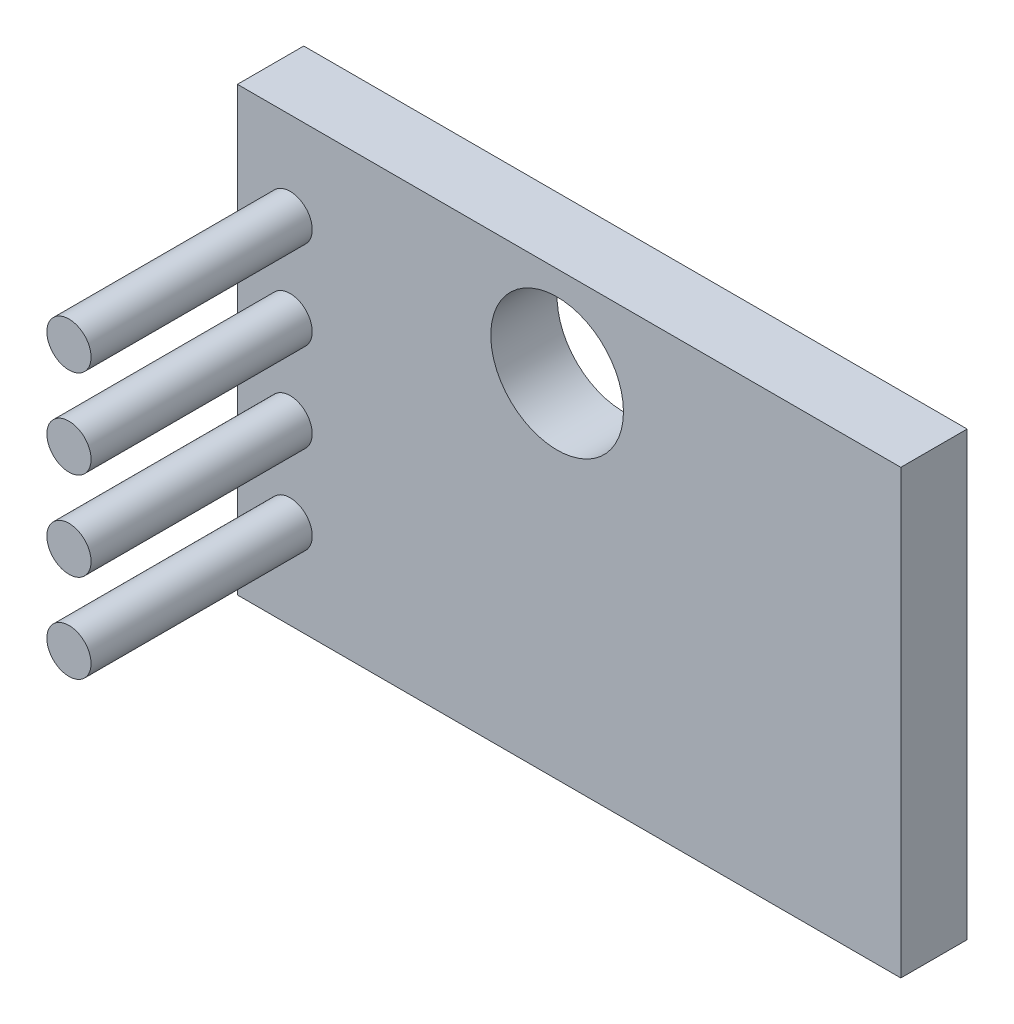
ISO-10303-21;
HEADER;
FILE_DESCRIPTION(('STEP AP214'),'2;1');
FILE_NAME('part.step','',(''),(''),'','','');
FILE_SCHEMA(('AUTOMOTIVE_DESIGN { 1 0 10303 214 1 1 1 1 }'));
ENDSEC;
DATA;
#1=APPLICATION_CONTEXT('core data for automotive mechanical design processes');
#2=APPLICATION_PROTOCOL_DEFINITION('international standard','automotive_design',2000,#1);
#3=PRODUCT_CONTEXT('',#1,'mechanical');
#4=PRODUCT('Part','Part','',(#3));
#5=PRODUCT_RELATED_PRODUCT_CATEGORY('part','',(#4));
#6=PRODUCT_DEFINITION_FORMATION('','',#4);
#7=PRODUCT_DEFINITION_CONTEXT('part definition',#1,'design');
#8=PRODUCT_DEFINITION('design','',#6,#7);
#9=PRODUCT_DEFINITION_SHAPE('','',#8);
#10=(LENGTH_UNIT() NAMED_UNIT(*) SI_UNIT(.MILLI.,.METRE.));
#11=(NAMED_UNIT(*) PLANE_ANGLE_UNIT() SI_UNIT($,.RADIAN.));
#12=(NAMED_UNIT(*) SI_UNIT($,.STERADIAN.) SOLID_ANGLE_UNIT());
#13=UNCERTAINTY_MEASURE_WITH_UNIT(LENGTH_MEASURE(1.E-05),#10,'distance_accuracy_value','');
#14=(GEOMETRIC_REPRESENTATION_CONTEXT(3) GLOBAL_UNCERTAINTY_ASSIGNED_CONTEXT((#13)) GLOBAL_UNIT_ASSIGNED_CONTEXT((#10,
#11,#12)) REPRESENTATION_CONTEXT('',''));
#15=CARTESIAN_POINT('',(0.,0.,0.));
#16=DIRECTION('',(0.,0.,1.));
#17=DIRECTION('',(1.,0.,0.));
#18=AXIS2_PLACEMENT_3D('',#15,#16,#17);
#19=CARTESIAN_POINT('',(0.,0.,1.5));
#20=DIRECTION('',(0.,0.,-1.));
#21=DIRECTION('',(-1.,0.,0.));
#22=AXIS2_PLACEMENT_3D('',#19,#20,#21);
#23=PLANE('',#22);
#24=CARTESIAN_POINT('',(157.774202418967,66.5911476545182,1.5));
#25=DIRECTION('',(0.,0.,-1.));
#26=DIRECTION('',(-1.,0.,0.));
#27=AXIS2_PLACEMENT_3D('',#24,#25,#26);
#28=CIRCLE('',#27,0.499999999999999);
#29=CARTESIAN_POINT('',(157.274202418967,66.5911476545182,1.5));
#30=VERTEX_POINT('',#29);
#31=EDGE_CURVE('E11',#30,#30,#28,.F.);
#32=ORIENTED_EDGE('',*,*,#31,.F.);
#33=EDGE_LOOP('',(#32));
#34=FACE_BOUND('',#33,.T.);
#35=CARTESIAN_POINT('',(157.774202418967,64.5911476545182,1.5));
#36=DIRECTION('',(0.,0.,-1.));
#37=DIRECTION('',(-1.,0.,0.));
#38=AXIS2_PLACEMENT_3D('',#35,#36,#37);
#39=CIRCLE('',#38,0.499999999999999);
#40=CARTESIAN_POINT('',(157.274202418967,64.5911476545182,1.5));
#41=VERTEX_POINT('',#40);
#42=EDGE_CURVE('E41',#41,#41,#39,.F.);
#43=ORIENTED_EDGE('',*,*,#42,.F.);
#44=EDGE_LOOP('',(#43));
#45=FACE_BOUND('',#44,.T.);
#46=CARTESIAN_POINT('',(157.774202418967,70.5911476545182,1.5));
#47=DIRECTION('',(0.,0.,-1.));
#48=DIRECTION('',(-1.,0.,0.));
#49=AXIS2_PLACEMENT_3D('',#46,#47,#48);
#50=CIRCLE('',#49,0.499999999999999);
#51=CARTESIAN_POINT('',(157.274202418967,70.5911476545182,1.5));
#52=VERTEX_POINT('',#51);
#53=EDGE_CURVE('E113',#52,#52,#50,.F.);
#54=ORIENTED_EDGE('',*,*,#53,.F.);
#55=EDGE_LOOP('',(#54));
#56=FACE_BOUND('',#55,.T.);
#57=CARTESIAN_POINT('',(157.774202418967,68.5911476545182,1.5));
#58=DIRECTION('',(0.,0.,-1.));
#59=DIRECTION('',(-1.,0.,0.));
#60=AXIS2_PLACEMENT_3D('',#57,#58,#59);
#61=CIRCLE('',#60,0.499999999999999);
#62=CARTESIAN_POINT('',(157.274202418967,68.5911476545182,1.5));
#63=VERTEX_POINT('',#62);
#64=EDGE_CURVE('E110',#63,#63,#61,.F.);
#65=ORIENTED_EDGE('',*,*,#64,.F.);
#66=EDGE_LOOP('',(#65));
#67=FACE_BOUND('',#66,.T.);
#68=DIRECTION('',(0.,-1.,0.));
#69=VECTOR('',#68,1.);
#70=CARTESIAN_POINT('',(156.583059713969,62.5911476545182,1.5));
#71=LINE('',#70,#69);
#72=CARTESIAN_POINT('',(156.583059713969,72.5911476545182,1.5));
#73=VERTEX_POINT('',#72);
#74=CARTESIAN_POINT('',(156.583059713969,62.5911476545182,1.5));
#75=VERTEX_POINT('',#74);
#76=EDGE_CURVE('E85',#73,#75,#71,.T.);
#77=ORIENTED_EDGE('',*,*,#76,.T.);
#78=DIRECTION('',(1.,0.,0.));
#79=VECTOR('',#78,1.);
#80=CARTESIAN_POINT('',(156.583059713969,62.5911476545182,1.5));
#81=LINE('',#80,#79);
#82=CARTESIAN_POINT('',(171.583059713969,62.5911476545182,1.5));
#83=VERTEX_POINT('',#82);
#84=EDGE_CURVE('E80',#75,#83,#81,.T.);
#85=ORIENTED_EDGE('',*,*,#84,.T.);
#86=DIRECTION('',(0.,1.,0.));
#87=VECTOR('',#86,1.);
#88=CARTESIAN_POINT('',(171.583059713969,62.5911476545182,1.5));
#89=LINE('',#88,#87);
#90=CARTESIAN_POINT('',(171.583059713969,72.5911476545182,1.5));
#91=VERTEX_POINT('',#90);
#92=EDGE_CURVE('E83',#83,#91,#89,.T.);
#93=ORIENTED_EDGE('',*,*,#92,.T.);
#94=DIRECTION('',(-1.,0.,0.));
#95=VECTOR('',#94,1.);
#96=CARTESIAN_POINT('',(156.583059713969,72.5911476545182,1.5));
#97=LINE('',#96,#95);
#98=EDGE_CURVE('E49',#91,#73,#97,.T.);
#99=ORIENTED_EDGE('',*,*,#98,.T.);
#100=EDGE_LOOP('',(#77,#85,#93,#99));
#101=FACE_BOUND('',#100,.T.);
#102=CARTESIAN_POINT('',(163.811741983301,70.542925261811,1.5));
#103=DIRECTION('',(0.,0.,1.));
#104=DIRECTION('',(1.,0.,0.));
#105=AXIS2_PLACEMENT_3D('',#102,#103,#104);
#106=CIRCLE('',#105,1.5);
#107=CARTESIAN_POINT('',(165.311741983301,70.542925261811,1.5));
#108=VERTEX_POINT('',#107);
#109=EDGE_CURVE('E103',#108,#108,#106,.T.);
#110=ORIENTED_EDGE('',*,*,#109,.F.);
#111=EDGE_LOOP('',(#110));
#112=FACE_BOUND('',#111,.T.);
#113=ADVANCED_FACE('F32',(#34,#45,#56,#67,#101,#112),#23,.F.);
#114=CARTESIAN_POINT('',(0.,0.,0.));
#115=DIRECTION('',(0.,0.,-1.));
#116=DIRECTION('',(-1.,0.,0.));
#117=AXIS2_PLACEMENT_3D('',#114,#115,#116);
#118=PLANE('',#117);
#119=DIRECTION('',(0.,-1.,0.));
#120=VECTOR('',#119,1.);
#121=CARTESIAN_POINT('',(156.583059713969,62.5911476545182,0.));
#122=LINE('',#121,#120);
#123=CARTESIAN_POINT('',(156.583059713969,72.5911476545182,0.));
#124=VERTEX_POINT('',#123);
#125=CARTESIAN_POINT('',(156.583059713969,62.5911476545182,0.));
#126=VERTEX_POINT('',#125);
#127=EDGE_CURVE('E100',#124,#126,#122,.T.);
#128=ORIENTED_EDGE('',*,*,#127,.F.);
#129=DIRECTION('',(-1.,0.,0.));
#130=VECTOR('',#129,1.);
#131=CARTESIAN_POINT('',(156.583059713969,72.5911476545182,0.));
#132=LINE('',#131,#130);
#133=CARTESIAN_POINT('',(171.583059713969,72.5911476545182,0.));
#134=VERTEX_POINT('',#133);
#135=EDGE_CURVE('E72',#134,#124,#132,.T.);
#136=ORIENTED_EDGE('',*,*,#135,.F.);
#137=DIRECTION('',(0.,1.,0.));
#138=VECTOR('',#137,1.);
#139=CARTESIAN_POINT('',(171.583059713969,62.5911476545182,0.));
#140=LINE('',#139,#138);
#141=CARTESIAN_POINT('',(171.583059713969,62.5911476545182,0.));
#142=VERTEX_POINT('',#141);
#143=EDGE_CURVE('E66',#142,#134,#140,.T.);
#144=ORIENTED_EDGE('',*,*,#143,.F.);
#145=DIRECTION('',(1.,0.,0.));
#146=VECTOR('',#145,1.);
#147=CARTESIAN_POINT('',(156.583059713969,62.5911476545182,0.));
#148=LINE('',#147,#146);
#149=EDGE_CURVE('E90',#126,#142,#148,.T.);
#150=ORIENTED_EDGE('',*,*,#149,.F.);
#151=EDGE_LOOP('',(#128,#136,#144,#150));
#152=FACE_BOUND('',#151,.T.);
#153=CARTESIAN_POINT('',(163.811741983301,70.542925261811,0.));
#154=DIRECTION('',(0.,0.,1.));
#155=DIRECTION('',(1.,0.,0.));
#156=AXIS2_PLACEMENT_3D('',#153,#154,#155);
#157=CIRCLE('',#156,1.5);
#158=CARTESIAN_POINT('',(165.311741983301,70.542925261811,0.));
#159=VERTEX_POINT('',#158);
#160=EDGE_CURVE('E165',#159,#159,#157,.T.);
#161=ORIENTED_EDGE('',*,*,#160,.T.);
#162=EDGE_LOOP('',(#161));
#163=FACE_BOUND('',#162,.T.);
#164=ADVANCED_FACE('F122',(#152,#163),#118,.T.);
#165=CARTESIAN_POINT('',(156.583059713969,62.5911476545182,1.5));
#166=DIRECTION('',(1.,0.,0.));
#167=DIRECTION('',(0.,0.,-1.));
#168=AXIS2_PLACEMENT_3D('',#165,#166,#167);
#169=PLANE('',#168);
#170=ORIENTED_EDGE('',*,*,#127,.T.);
#171=DIRECTION('',(0.,0.,-1.));
#172=VECTOR('',#171,1.);
#173=CARTESIAN_POINT('',(156.583059713969,62.5911476545182,1.5));
#174=LINE('',#173,#172);
#175=EDGE_CURVE('E91',#75,#126,#174,.T.);
#176=ORIENTED_EDGE('',*,*,#175,.F.);
#177=ORIENTED_EDGE('',*,*,#76,.F.);
#178=DIRECTION('',(0.,0.,-1.));
#179=VECTOR('',#178,1.);
#180=CARTESIAN_POINT('',(156.583059713969,72.5911476545182,1.5));
#181=LINE('',#180,#179);
#182=EDGE_CURVE('E96',#73,#124,#181,.T.);
#183=ORIENTED_EDGE('',*,*,#182,.T.);
#184=EDGE_LOOP('',(#170,#176,#177,#183));
#185=FACE_BOUND('',#184,.T.);
#186=ADVANCED_FACE('F34',(#185),#169,.F.);
#187=CARTESIAN_POINT('',(156.583059713969,62.5911476545182,1.5));
#188=DIRECTION('',(0.,1.,0.));
#189=DIRECTION('',(0.,0.,1.));
#190=AXIS2_PLACEMENT_3D('',#187,#188,#189);
#191=PLANE('',#190);
#192=ORIENTED_EDGE('',*,*,#149,.T.);
#193=DIRECTION('',(0.,0.,-1.));
#194=VECTOR('',#193,1.);
#195=CARTESIAN_POINT('',(171.583059713969,62.5911476545182,1.5));
#196=LINE('',#195,#194);
#197=EDGE_CURVE('E88',#83,#142,#196,.T.);
#198=ORIENTED_EDGE('',*,*,#197,.F.);
#199=ORIENTED_EDGE('',*,*,#84,.F.);
#200=ORIENTED_EDGE('',*,*,#175,.T.);
#201=EDGE_LOOP('',(#192,#198,#199,#200));
#202=FACE_BOUND('',#201,.T.);
#203=ADVANCED_FACE('F89',(#202),#191,.F.);
#204=CARTESIAN_POINT('',(171.583059713969,62.5911476545182,1.5));
#205=DIRECTION('',(-1.,0.,0.));
#206=DIRECTION('',(0.,0.,1.));
#207=AXIS2_PLACEMENT_3D('',#204,#205,#206);
#208=PLANE('',#207);
#209=ORIENTED_EDGE('',*,*,#143,.T.);
#210=DIRECTION('',(0.,0.,-1.));
#211=VECTOR('',#210,1.);
#212=CARTESIAN_POINT('',(171.583059713969,72.5911476545182,1.5));
#213=LINE('',#212,#211);
#214=EDGE_CURVE('E92',#91,#134,#213,.T.);
#215=ORIENTED_EDGE('',*,*,#214,.F.);
#216=ORIENTED_EDGE('',*,*,#92,.F.);
#217=ORIENTED_EDGE('',*,*,#197,.T.);
#218=EDGE_LOOP('',(#209,#215,#216,#217));
#219=FACE_BOUND('',#218,.T.);
#220=ADVANCED_FACE('F94',(#219),#208,.F.);
#221=CARTESIAN_POINT('',(156.583059713969,72.5911476545182,1.5));
#222=DIRECTION('',(0.,-1.,0.));
#223=DIRECTION('',(0.,0.,-1.));
#224=AXIS2_PLACEMENT_3D('',#221,#222,#223);
#225=PLANE('',#224);
#226=ORIENTED_EDGE('',*,*,#135,.T.);
#227=ORIENTED_EDGE('',*,*,#182,.F.);
#228=ORIENTED_EDGE('',*,*,#98,.F.);
#229=ORIENTED_EDGE('',*,*,#214,.T.);
#230=EDGE_LOOP('',(#226,#227,#228,#229));
#231=FACE_BOUND('',#230,.T.);
#232=ADVANCED_FACE('F142',(#231),#225,.F.);
#233=CARTESIAN_POINT('',(163.811741983301,70.542925261811,1.5));
#234=DIRECTION('',(0.,0.,-1.));
#235=DIRECTION('',(-1.,0.,0.));
#236=AXIS2_PLACEMENT_3D('',#233,#234,#235);
#237=CYLINDRICAL_SURFACE('',#236,1.5);
#238=ORIENTED_EDGE('',*,*,#109,.T.);
#239=EDGE_LOOP('',(#238));
#240=FACE_BOUND('',#239,.T.);
#241=ORIENTED_EDGE('',*,*,#160,.F.);
#242=EDGE_LOOP('',(#241));
#243=FACE_BOUND('',#242,.T.);
#244=ADVANCED_FACE('F132',(#240,#243),#237,.F.);
#245=CARTESIAN_POINT('',(157.774202418967,68.5911476545182,6.5));
#246=DIRECTION('',(0.,0.,-1.));
#247=DIRECTION('',(-1.,0.,0.));
#248=AXIS2_PLACEMENT_3D('',#245,#246,#247);
#249=CYLINDRICAL_SURFACE('',#248,0.499999999999999);
#250=CARTESIAN_POINT('',(157.774202418967,68.5911476545182,6.5));
#251=DIRECTION('',(0.,0.,1.));
#252=DIRECTION('',(1.,0.,0.));
#253=AXIS2_PLACEMENT_3D('',#250,#251,#252);
#254=CIRCLE('',#253,0.499999999999999);
#255=CARTESIAN_POINT('',(158.274202418967,68.5911476545182,6.5));
#256=VERTEX_POINT('',#255);
#257=EDGE_CURVE('E167',#256,#256,#254,.T.);
#258=ORIENTED_EDGE('',*,*,#257,.F.);
#259=EDGE_LOOP('',(#258));
#260=FACE_BOUND('',#259,.T.);
#261=ORIENTED_EDGE('',*,*,#64,.T.);
#262=EDGE_LOOP('',(#261));
#263=FACE_BOUND('',#262,.T.);
#264=ADVANCED_FACE('F129',(#260,#263),#249,.T.);
#265=CARTESIAN_POINT('',(157.774202418967,68.5911476545182,6.5));
#266=DIRECTION('',(0.,0.,1.));
#267=DIRECTION('',(1.,0.,0.));
#268=AXIS2_PLACEMENT_3D('',#265,#266,#267);
#269=PLANE('',#268);
#270=ORIENTED_EDGE('',*,*,#257,.T.);
#271=EDGE_LOOP('',(#270));
#272=FACE_BOUND('',#271,.T.);
#273=ADVANCED_FACE('F131',(#272),#269,.T.);
#274=CARTESIAN_POINT('',(157.774202418967,70.5911476545182,6.5));
#275=DIRECTION('',(0.,0.,-1.));
#276=DIRECTION('',(-1.,0.,0.));
#277=AXIS2_PLACEMENT_3D('',#274,#275,#276);
#278=CYLINDRICAL_SURFACE('',#277,0.499999999999999);
#279=CARTESIAN_POINT('',(157.774202418967,70.5911476545182,6.5));
#280=DIRECTION('',(0.,0.,1.));
#281=DIRECTION('',(1.,0.,0.));
#282=AXIS2_PLACEMENT_3D('',#279,#280,#281);
#283=CIRCLE('',#282,0.499999999999999);
#284=CARTESIAN_POINT('',(158.274202418967,70.5911476545182,6.5));
#285=VERTEX_POINT('',#284);
#286=EDGE_CURVE('E172',#285,#285,#283,.T.);
#287=ORIENTED_EDGE('',*,*,#286,.F.);
#288=EDGE_LOOP('',(#287));
#289=FACE_BOUND('',#288,.T.);
#290=ORIENTED_EDGE('',*,*,#53,.T.);
#291=EDGE_LOOP('',(#290));
#292=FACE_BOUND('',#291,.T.);
#293=ADVANCED_FACE('F139',(#289,#292),#278,.T.);
#294=CARTESIAN_POINT('',(157.774202418967,70.5911476545182,6.5));
#295=DIRECTION('',(0.,0.,1.));
#296=DIRECTION('',(1.,0.,0.));
#297=AXIS2_PLACEMENT_3D('',#294,#295,#296);
#298=PLANE('',#297);
#299=ORIENTED_EDGE('',*,*,#286,.T.);
#300=EDGE_LOOP('',(#299));
#301=FACE_BOUND('',#300,.T.);
#302=ADVANCED_FACE('F202',(#301),#298,.T.);
#303=CARTESIAN_POINT('',(157.774202418967,64.5911476545182,6.5));
#304=DIRECTION('',(0.,0.,-1.));
#305=DIRECTION('',(-1.,0.,0.));
#306=AXIS2_PLACEMENT_3D('',#303,#304,#305);
#307=CYLINDRICAL_SURFACE('',#306,0.499999999999999);
#308=CARTESIAN_POINT('',(157.774202418967,64.5911476545182,6.5));
#309=DIRECTION('',(0.,0.,1.));
#310=DIRECTION('',(-1.,0.,0.));
#311=AXIS2_PLACEMENT_3D('',#308,#309,#310);
#312=CIRCLE('',#311,0.499999999999999);
#313=CARTESIAN_POINT('',(157.274202418967,64.5911476545182,6.5));
#314=VERTEX_POINT('',#313);
#315=EDGE_CURVE('E177',#314,#314,#312,.T.);
#316=ORIENTED_EDGE('',*,*,#315,.F.);
#317=EDGE_LOOP('',(#316));
#318=FACE_BOUND('',#317,.T.);
#319=ORIENTED_EDGE('',*,*,#42,.T.);
#320=EDGE_LOOP('',(#319));
#321=FACE_BOUND('',#320,.T.);
#322=ADVANCED_FACE('F118',(#318,#321),#307,.T.);
#323=CARTESIAN_POINT('',(157.774202418967,64.5911476545182,6.5));
#324=DIRECTION('',(0.,0.,-1.));
#325=DIRECTION('',(-1.,0.,0.));
#326=AXIS2_PLACEMENT_3D('',#323,#324,#325);
#327=PLANE('',#326);
#328=ORIENTED_EDGE('',*,*,#315,.T.);
#329=EDGE_LOOP('',(#328));
#330=FACE_BOUND('',#329,.T.);
#331=ADVANCED_FACE('F189',(#330),#327,.F.);
#332=CARTESIAN_POINT('',(157.774202418967,66.5911476545182,6.5));
#333=DIRECTION('',(0.,0.,-1.));
#334=DIRECTION('',(-1.,0.,0.));
#335=AXIS2_PLACEMENT_3D('',#332,#333,#334);
#336=CYLINDRICAL_SURFACE('',#335,0.499999999999999);
#337=CARTESIAN_POINT('',(157.774202418967,66.5911476545182,6.5));
#338=DIRECTION('',(0.,0.,1.));
#339=DIRECTION('',(-1.,0.,0.));
#340=AXIS2_PLACEMENT_3D('',#337,#338,#339);
#341=CIRCLE('',#340,0.499999999999999);
#342=CARTESIAN_POINT('',(157.274202418967,66.5911476545182,6.5));
#343=VERTEX_POINT('',#342);
#344=EDGE_CURVE('E180',#343,#343,#341,.T.);
#345=ORIENTED_EDGE('',*,*,#344,.F.);
#346=EDGE_LOOP('',(#345));
#347=FACE_BOUND('',#346,.T.);
#348=ORIENTED_EDGE('',*,*,#31,.T.);
#349=EDGE_LOOP('',(#348));
#350=FACE_BOUND('',#349,.T.);
#351=ADVANCED_FACE('F186',(#347,#350),#336,.T.);
#352=CARTESIAN_POINT('',(157.774202418967,66.5911476545182,6.5));
#353=DIRECTION('',(0.,0.,-1.));
#354=DIRECTION('',(-1.,0.,0.));
#355=AXIS2_PLACEMENT_3D('',#352,#353,#354);
#356=PLANE('',#355);
#357=ORIENTED_EDGE('',*,*,#344,.T.);
#358=EDGE_LOOP('',(#357));
#359=FACE_BOUND('',#358,.T.);
#360=ADVANCED_FACE('F184',(#359),#356,.F.);
#361=CLOSED_SHELL('',(#113,#164,#186,#203,#220,#232,#244,#264,#273,#293,#302,#322,#331,#351,#360));
#362=MANIFOLD_SOLID_BREP('B2',#361);
#363=ADVANCED_BREP_SHAPE_REPRESENTATION('',(#18,#362),#14);
#364=SHAPE_DEFINITION_REPRESENTATION(#9,#363);
ENDSEC;
END-ISO-10303-21;
